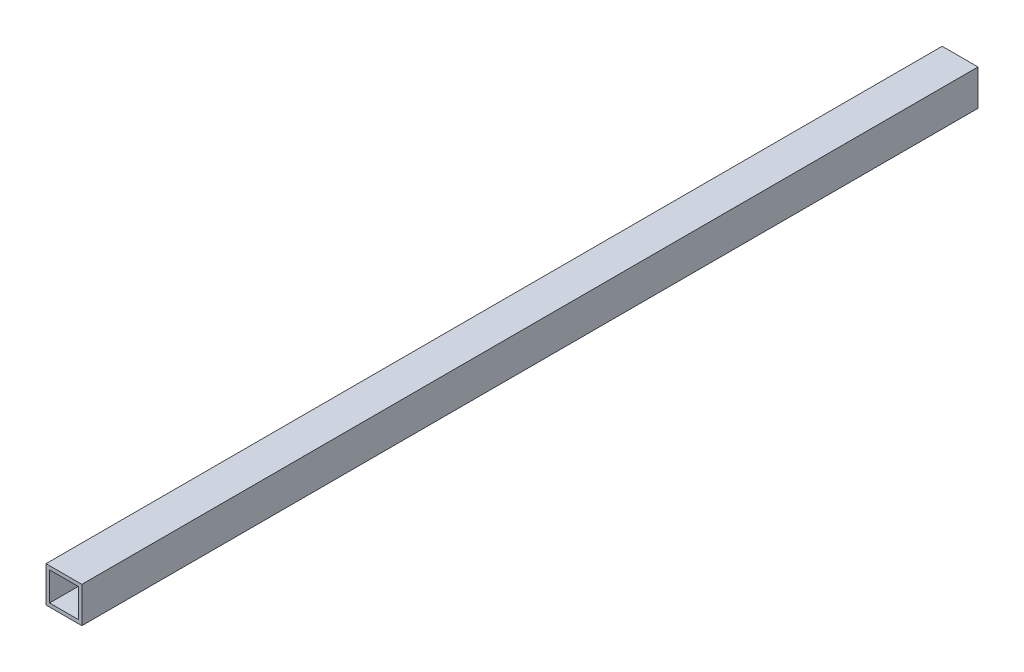
ISO-10303-21;
HEADER;
FILE_DESCRIPTION(('STEP AP214'),'2;1');
FILE_NAME('part.step','',(''),(''),'','','');
FILE_SCHEMA(('AUTOMOTIVE_DESIGN { 1 0 10303 214 1 1 1 1 }'));
ENDSEC;
DATA;
#1=APPLICATION_CONTEXT('core data for automotive mechanical design processes');
#2=APPLICATION_PROTOCOL_DEFINITION('international standard','automotive_design',2000,#1);
#3=PRODUCT_CONTEXT('',#1,'mechanical');
#4=PRODUCT('Part','Part','',(#3));
#5=PRODUCT_RELATED_PRODUCT_CATEGORY('part','',(#4));
#6=PRODUCT_DEFINITION_FORMATION('','',#4);
#7=PRODUCT_DEFINITION_CONTEXT('part definition',#1,'design');
#8=PRODUCT_DEFINITION('design','',#6,#7);
#9=PRODUCT_DEFINITION_SHAPE('','',#8);
#10=(LENGTH_UNIT() NAMED_UNIT(*) SI_UNIT(.MILLI.,.METRE.));
#11=(NAMED_UNIT(*) PLANE_ANGLE_UNIT() SI_UNIT($,.RADIAN.));
#12=(NAMED_UNIT(*) SI_UNIT($,.STERADIAN.) SOLID_ANGLE_UNIT());
#13=UNCERTAINTY_MEASURE_WITH_UNIT(LENGTH_MEASURE(1.E-05),#10,'distance_accuracy_value','');
#14=(GEOMETRIC_REPRESENTATION_CONTEXT(3) GLOBAL_UNCERTAINTY_ASSIGNED_CONTEXT((#13)) GLOBAL_UNIT_ASSIGNED_CONTEXT((#10,
#11,#12)) REPRESENTATION_CONTEXT('',''));
#15=CARTESIAN_POINT('',(0.,0.,0.));
#16=DIRECTION('',(0.,0.,1.));
#17=DIRECTION('',(1.,0.,0.));
#18=AXIS2_PLACEMENT_3D('',#15,#16,#17);
#19=CARTESIAN_POINT('',(0.,0.,500.));
#20=DIRECTION('',(0.,0.,-1.));
#21=DIRECTION('',(-1.,0.,0.));
#22=AXIS2_PLACEMENT_3D('',#19,#20,#21);
#23=PLANE('',#22);
#24=DIRECTION('',(0.,1.,0.));
#25=VECTOR('',#24,1.);
#26=CARTESIAN_POINT('',(10.,-10.,500.));
#27=LINE('',#26,#25);
#28=CARTESIAN_POINT('',(10.,-10.,500.));
#29=VERTEX_POINT('',#28);
#30=CARTESIAN_POINT('',(10.,10.,500.));
#31=VERTEX_POINT('',#30);
#32=EDGE_CURVE('E135',#29,#31,#27,.T.);
#33=ORIENTED_EDGE('',*,*,#32,.T.);
#34=DIRECTION('',(-1.,0.,0.));
#35=VECTOR('',#34,1.);
#36=CARTESIAN_POINT('',(-10.,10.,500.));
#37=LINE('',#36,#35);
#38=CARTESIAN_POINT('',(-10.,10.,500.));
#39=VERTEX_POINT('',#38);
#40=EDGE_CURVE('E138',#31,#39,#37,.T.);
#41=ORIENTED_EDGE('',*,*,#40,.T.);
#42=DIRECTION('',(0.,-1.,0.));
#43=VECTOR('',#42,1.);
#44=CARTESIAN_POINT('',(-10.,-10.,500.));
#45=LINE('',#44,#43);
#46=CARTESIAN_POINT('',(-10.,-10.,500.));
#47=VERTEX_POINT('',#46);
#48=EDGE_CURVE('E141',#39,#47,#45,.T.);
#49=ORIENTED_EDGE('',*,*,#48,.T.);
#50=DIRECTION('',(1.,0.,0.));
#51=VECTOR('',#50,1.);
#52=CARTESIAN_POINT('',(-10.,-10.,500.));
#53=LINE('',#52,#51);
#54=EDGE_CURVE('E143',#47,#29,#53,.T.);
#55=ORIENTED_EDGE('',*,*,#54,.T.);
#56=EDGE_LOOP('',(#33,#41,#49,#55));
#57=FACE_BOUND('',#56,.T.);
#58=DIRECTION('',(0.,-1.,0.));
#59=VECTOR('',#58,1.);
#60=CARTESIAN_POINT('',(-8.,-8.,500.));
#61=LINE('',#60,#59);
#62=CARTESIAN_POINT('',(-8.,8.,500.));
#63=VERTEX_POINT('',#62);
#64=CARTESIAN_POINT('',(-8.,-8.,500.));
#65=VERTEX_POINT('',#64);
#66=EDGE_CURVE('E99',#63,#65,#61,.T.);
#67=ORIENTED_EDGE('',*,*,#66,.F.);
#68=DIRECTION('',(-1.,0.,0.));
#69=VECTOR('',#68,1.);
#70=CARTESIAN_POINT('',(-8.,8.,500.));
#71=LINE('',#70,#69);
#72=CARTESIAN_POINT('',(8.,8.,500.));
#73=VERTEX_POINT('',#72);
#74=EDGE_CURVE('E121',#73,#63,#71,.T.);
#75=ORIENTED_EDGE('',*,*,#74,.F.);
#76=DIRECTION('',(0.,1.,0.));
#77=VECTOR('',#76,1.);
#78=CARTESIAN_POINT('',(8.,-8.,500.));
#79=LINE('',#78,#77);
#80=CARTESIAN_POINT('',(8.,-8.,500.));
#81=VERTEX_POINT('',#80);
#82=EDGE_CURVE('E119',#81,#73,#79,.T.);
#83=ORIENTED_EDGE('',*,*,#82,.F.);
#84=DIRECTION('',(1.,0.,0.));
#85=VECTOR('',#84,1.);
#86=CARTESIAN_POINT('',(-8.,-8.,500.));
#87=LINE('',#86,#85);
#88=EDGE_CURVE('E107',#65,#81,#87,.T.);
#89=ORIENTED_EDGE('',*,*,#88,.F.);
#90=EDGE_LOOP('',(#67,#75,#83,#89));
#91=FACE_BOUND('',#90,.T.);
#92=ADVANCED_FACE('F34',(#57,#91),#23,.F.);
#93=CARTESIAN_POINT('',(0.,0.,0.));
#94=DIRECTION('',(0.,0.,-1.));
#95=DIRECTION('',(-1.,0.,0.));
#96=AXIS2_PLACEMENT_3D('',#93,#94,#95);
#97=PLANE('',#96);
#98=DIRECTION('',(0.,1.,0.));
#99=VECTOR('',#98,1.);
#100=CARTESIAN_POINT('',(10.,-10.,0.));
#101=LINE('',#100,#99);
#102=CARTESIAN_POINT('',(10.,-10.,0.));
#103=VERTEX_POINT('',#102);
#104=CARTESIAN_POINT('',(10.,10.,0.));
#105=VERTEX_POINT('',#104);
#106=EDGE_CURVE('E115',#103,#105,#101,.T.);
#107=ORIENTED_EDGE('',*,*,#106,.F.);
#108=DIRECTION('',(1.,0.,0.));
#109=VECTOR('',#108,1.);
#110=CARTESIAN_POINT('',(-10.,-10.,0.));
#111=LINE('',#110,#109);
#112=CARTESIAN_POINT('',(-10.,-10.,0.));
#113=VERTEX_POINT('',#112);
#114=EDGE_CURVE('E139',#113,#103,#111,.T.);
#115=ORIENTED_EDGE('',*,*,#114,.F.);
#116=DIRECTION('',(0.,-1.,0.));
#117=VECTOR('',#116,1.);
#118=CARTESIAN_POINT('',(-10.,-10.,0.));
#119=LINE('',#118,#117);
#120=CARTESIAN_POINT('',(-10.,10.,0.));
#121=VERTEX_POINT('',#120);
#122=EDGE_CURVE('E150',#121,#113,#119,.T.);
#123=ORIENTED_EDGE('',*,*,#122,.F.);
#124=DIRECTION('',(-1.,0.,0.));
#125=VECTOR('',#124,1.);
#126=CARTESIAN_POINT('',(-10.,10.,0.));
#127=LINE('',#126,#125);
#128=EDGE_CURVE('E148',#105,#121,#127,.T.);
#129=ORIENTED_EDGE('',*,*,#128,.F.);
#130=EDGE_LOOP('',(#107,#115,#123,#129));
#131=FACE_BOUND('',#130,.T.);
#132=DIRECTION('',(-1.,0.,0.));
#133=VECTOR('',#132,1.);
#134=CARTESIAN_POINT('',(-8.,8.,0.));
#135=LINE('',#134,#133);
#136=CARTESIAN_POINT('',(8.,8.,0.));
#137=VERTEX_POINT('',#136);
#138=CARTESIAN_POINT('',(-8.,8.,0.));
#139=VERTEX_POINT('',#138);
#140=EDGE_CURVE('E108',#137,#139,#135,.T.);
#141=ORIENTED_EDGE('',*,*,#140,.T.);
#142=DIRECTION('',(0.,-1.,0.));
#143=VECTOR('',#142,1.);
#144=CARTESIAN_POINT('',(-8.,-8.,0.));
#145=LINE('',#144,#143);
#146=CARTESIAN_POINT('',(-8.,-8.,0.));
#147=VERTEX_POINT('',#146);
#148=EDGE_CURVE('E57',#139,#147,#145,.T.);
#149=ORIENTED_EDGE('',*,*,#148,.T.);
#150=DIRECTION('',(1.,0.,0.));
#151=VECTOR('',#150,1.);
#152=CARTESIAN_POINT('',(-8.,-8.,0.));
#153=LINE('',#152,#151);
#154=CARTESIAN_POINT('',(8.,-8.,0.));
#155=VERTEX_POINT('',#154);
#156=EDGE_CURVE('E114',#147,#155,#153,.T.);
#157=ORIENTED_EDGE('',*,*,#156,.T.);
#158=DIRECTION('',(0.,1.,0.));
#159=VECTOR('',#158,1.);
#160=CARTESIAN_POINT('',(8.,-8.,0.));
#161=LINE('',#160,#159);
#162=EDGE_CURVE('E127',#155,#137,#161,.T.);
#163=ORIENTED_EDGE('',*,*,#162,.T.);
#164=EDGE_LOOP('',(#141,#149,#157,#163));
#165=FACE_BOUND('',#164,.T.);
#166=ADVANCED_FACE('F168',(#131,#165),#97,.T.);
#167=CARTESIAN_POINT('',(10.,-10.,500.));
#168=DIRECTION('',(-1.,0.,0.));
#169=DIRECTION('',(0.,0.,1.));
#170=AXIS2_PLACEMENT_3D('',#167,#168,#169);
#171=PLANE('',#170);
#172=ORIENTED_EDGE('',*,*,#106,.T.);
#173=DIRECTION('',(0.,0.,-1.));
#174=VECTOR('',#173,1.);
#175=CARTESIAN_POINT('',(10.,10.,500.));
#176=LINE('',#175,#174);
#177=EDGE_CURVE('E11',#31,#105,#176,.T.);
#178=ORIENTED_EDGE('',*,*,#177,.F.);
#179=ORIENTED_EDGE('',*,*,#32,.F.);
#180=DIRECTION('',(0.,0.,-1.));
#181=VECTOR('',#180,1.);
#182=CARTESIAN_POINT('',(10.,-10.,500.));
#183=LINE('',#182,#181);
#184=EDGE_CURVE('E145',#29,#103,#183,.T.);
#185=ORIENTED_EDGE('',*,*,#184,.T.);
#186=EDGE_LOOP('',(#172,#178,#179,#185));
#187=FACE_BOUND('',#186,.T.);
#188=ADVANCED_FACE('F36',(#187),#171,.F.);
#189=CARTESIAN_POINT('',(-10.,10.,500.));
#190=DIRECTION('',(0.,-1.,0.));
#191=DIRECTION('',(0.,0.,-1.));
#192=AXIS2_PLACEMENT_3D('',#189,#190,#191);
#193=PLANE('',#192);
#194=ORIENTED_EDGE('',*,*,#128,.T.);
#195=DIRECTION('',(0.,0.,-1.));
#196=VECTOR('',#195,1.);
#197=CARTESIAN_POINT('',(-10.,10.,500.));
#198=LINE('',#197,#196);
#199=EDGE_CURVE('E42',#39,#121,#198,.T.);
#200=ORIENTED_EDGE('',*,*,#199,.F.);
#201=ORIENTED_EDGE('',*,*,#40,.F.);
#202=ORIENTED_EDGE('',*,*,#177,.T.);
#203=EDGE_LOOP('',(#194,#200,#201,#202));
#204=FACE_BOUND('',#203,.T.);
#205=ADVANCED_FACE('F178',(#204),#193,.F.);
#206=CARTESIAN_POINT('',(-10.,-10.,500.));
#207=DIRECTION('',(1.,0.,0.));
#208=DIRECTION('',(0.,0.,-1.));
#209=AXIS2_PLACEMENT_3D('',#206,#207,#208);
#210=PLANE('',#209);
#211=ORIENTED_EDGE('',*,*,#122,.T.);
#212=DIRECTION('',(0.,0.,-1.));
#213=VECTOR('',#212,1.);
#214=CARTESIAN_POINT('',(-10.,-10.,500.));
#215=LINE('',#214,#213);
#216=EDGE_CURVE('E155',#47,#113,#215,.T.);
#217=ORIENTED_EDGE('',*,*,#216,.F.);
#218=ORIENTED_EDGE('',*,*,#48,.F.);
#219=ORIENTED_EDGE('',*,*,#199,.T.);
#220=EDGE_LOOP('',(#211,#217,#218,#219));
#221=FACE_BOUND('',#220,.T.);
#222=ADVANCED_FACE('F162',(#221),#210,.F.);
#223=CARTESIAN_POINT('',(-10.,-10.,500.));
#224=DIRECTION('',(0.,1.,0.));
#225=DIRECTION('',(0.,0.,1.));
#226=AXIS2_PLACEMENT_3D('',#223,#224,#225);
#227=PLANE('',#226);
#228=ORIENTED_EDGE('',*,*,#114,.T.);
#229=ORIENTED_EDGE('',*,*,#184,.F.);
#230=ORIENTED_EDGE('',*,*,#54,.F.);
#231=ORIENTED_EDGE('',*,*,#216,.T.);
#232=EDGE_LOOP('',(#228,#229,#230,#231));
#233=FACE_BOUND('',#232,.T.);
#234=ADVANCED_FACE('F172',(#233),#227,.F.);
#235=CARTESIAN_POINT('',(-8.,-8.,500.));
#236=DIRECTION('',(1.,0.,0.));
#237=DIRECTION('',(0.,0.,-1.));
#238=AXIS2_PLACEMENT_3D('',#235,#236,#237);
#239=PLANE('',#238);
#240=ORIENTED_EDGE('',*,*,#148,.F.);
#241=DIRECTION('',(0.,0.,-1.));
#242=VECTOR('',#241,1.);
#243=CARTESIAN_POINT('',(-8.,8.,500.));
#244=LINE('',#243,#242);
#245=EDGE_CURVE('E103',#63,#139,#244,.T.);
#246=ORIENTED_EDGE('',*,*,#245,.F.);
#247=ORIENTED_EDGE('',*,*,#66,.T.);
#248=DIRECTION('',(0.,0.,-1.));
#249=VECTOR('',#248,1.);
#250=CARTESIAN_POINT('',(-8.,-8.,500.));
#251=LINE('',#250,#249);
#252=EDGE_CURVE('E102',#65,#147,#251,.T.);
#253=ORIENTED_EDGE('',*,*,#252,.T.);
#254=EDGE_LOOP('',(#240,#246,#247,#253));
#255=FACE_BOUND('',#254,.T.);
#256=ADVANCED_FACE('F101',(#255),#239,.T.);
#257=CARTESIAN_POINT('',(-8.,-8.,500.));
#258=DIRECTION('',(0.,1.,0.));
#259=DIRECTION('',(0.,0.,1.));
#260=AXIS2_PLACEMENT_3D('',#257,#258,#259);
#261=PLANE('',#260);
#262=ORIENTED_EDGE('',*,*,#156,.F.);
#263=ORIENTED_EDGE('',*,*,#252,.F.);
#264=ORIENTED_EDGE('',*,*,#88,.T.);
#265=DIRECTION('',(0.,0.,-1.));
#266=VECTOR('',#265,1.);
#267=CARTESIAN_POINT('',(8.,-8.,500.));
#268=LINE('',#267,#266);
#269=EDGE_CURVE('E116',#81,#155,#268,.T.);
#270=ORIENTED_EDGE('',*,*,#269,.T.);
#271=EDGE_LOOP('',(#262,#263,#264,#270));
#272=FACE_BOUND('',#271,.T.);
#273=ADVANCED_FACE('F111',(#272),#261,.T.);
#274=CARTESIAN_POINT('',(8.,-8.,500.));
#275=DIRECTION('',(-1.,0.,0.));
#276=DIRECTION('',(0.,-1.,0.));
#277=AXIS2_PLACEMENT_3D('',#274,#275,#276);
#278=PLANE('',#277);
#279=ORIENTED_EDGE('',*,*,#162,.F.);
#280=ORIENTED_EDGE('',*,*,#269,.F.);
#281=ORIENTED_EDGE('',*,*,#82,.T.);
#282=DIRECTION('',(0.,0.,-1.));
#283=VECTOR('',#282,1.);
#284=CARTESIAN_POINT('',(8.,8.,500.));
#285=LINE('',#284,#283);
#286=EDGE_CURVE('E49',#73,#137,#285,.T.);
#287=ORIENTED_EDGE('',*,*,#286,.T.);
#288=EDGE_LOOP('',(#279,#280,#281,#287));
#289=FACE_BOUND('',#288,.T.);
#290=ADVANCED_FACE('F201',(#289),#278,.T.);
#291=CARTESIAN_POINT('',(-8.,8.,500.));
#292=DIRECTION('',(0.,-1.,0.));
#293=DIRECTION('',(1.,0.,0.));
#294=AXIS2_PLACEMENT_3D('',#291,#292,#293);
#295=PLANE('',#294);
#296=ORIENTED_EDGE('',*,*,#140,.F.);
#297=ORIENTED_EDGE('',*,*,#286,.F.);
#298=ORIENTED_EDGE('',*,*,#74,.T.);
#299=ORIENTED_EDGE('',*,*,#245,.T.);
#300=EDGE_LOOP('',(#296,#297,#298,#299));
#301=FACE_BOUND('',#300,.T.);
#302=ADVANCED_FACE('F205',(#301),#295,.T.);
#303=CLOSED_SHELL('',(#92,#166,#188,#205,#222,#234,#256,#273,#290,#302));
#304=MANIFOLD_SOLID_BREP('B2',#303);
#305=ADVANCED_BREP_SHAPE_REPRESENTATION('',(#18,#304),#14);
#306=SHAPE_DEFINITION_REPRESENTATION(#9,#305);
ENDSEC;
END-ISO-10303-21;
